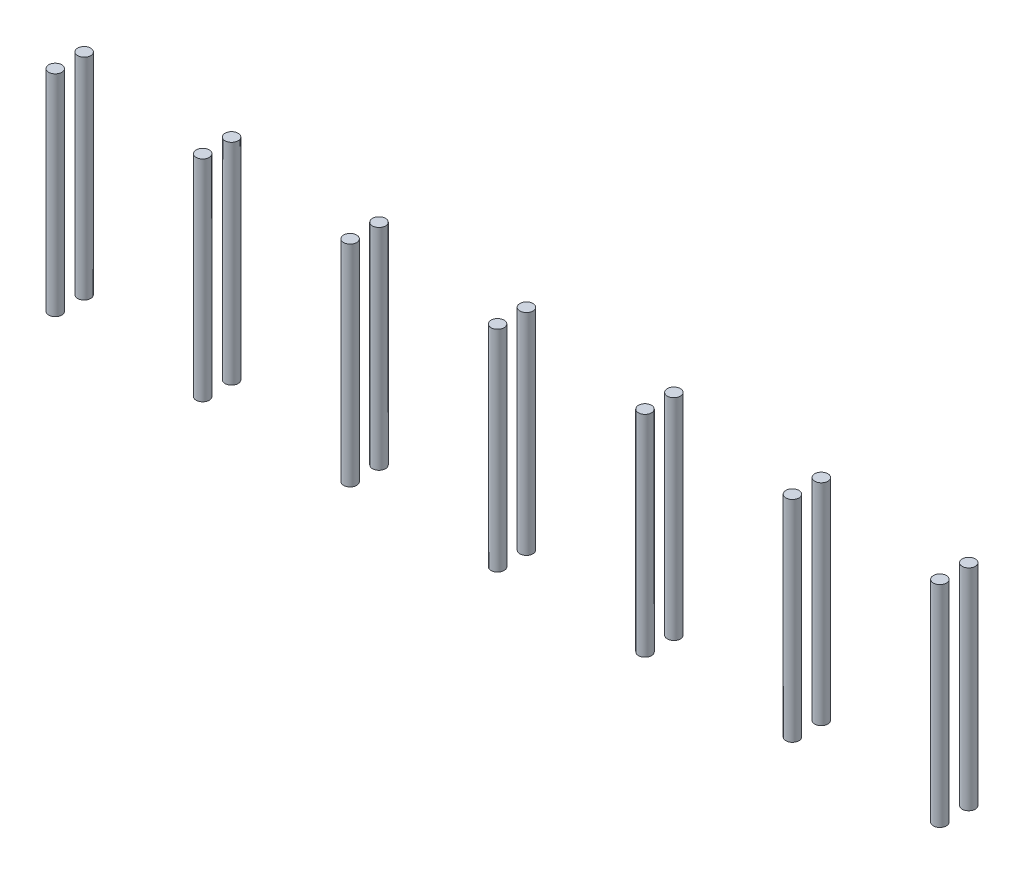
ISO-10303-21;
HEADER;
FILE_DESCRIPTION(('STEP AP214'),'2;1');
FILE_NAME('part.step','',(''),(''),'','','');
FILE_SCHEMA(('AUTOMOTIVE_DESIGN { 1 0 10303 214 1 1 1 1 }'));
ENDSEC;
DATA;
#1=APPLICATION_CONTEXT('core data for automotive mechanical design processes');
#2=APPLICATION_PROTOCOL_DEFINITION('international standard','automotive_design',2000,#1);
#3=PRODUCT_CONTEXT('',#1,'mechanical');
#4=PRODUCT('Part','Part','',(#3));
#5=PRODUCT_RELATED_PRODUCT_CATEGORY('part','',(#4));
#6=PRODUCT_DEFINITION_FORMATION('','',#4);
#7=PRODUCT_DEFINITION_CONTEXT('part definition',#1,'design');
#8=PRODUCT_DEFINITION('design','',#6,#7);
#9=PRODUCT_DEFINITION_SHAPE('','',#8);
#10=(LENGTH_UNIT() NAMED_UNIT(*) SI_UNIT(.MILLI.,.METRE.));
#11=(NAMED_UNIT(*) PLANE_ANGLE_UNIT() SI_UNIT($,.RADIAN.));
#12=(NAMED_UNIT(*) SI_UNIT($,.STERADIAN.) SOLID_ANGLE_UNIT());
#13=UNCERTAINTY_MEASURE_WITH_UNIT(LENGTH_MEASURE(1.E-05),#10,'distance_accuracy_value','');
#14=(GEOMETRIC_REPRESENTATION_CONTEXT(3) GLOBAL_UNCERTAINTY_ASSIGNED_CONTEXT((#13)) GLOBAL_UNIT_ASSIGNED_CONTEXT((#10,
#11,#12)) REPRESENTATION_CONTEXT('',''));
#15=CARTESIAN_POINT('',(0.,0.,0.));
#16=DIRECTION('',(0.,0.,1.));
#17=DIRECTION('',(1.,0.,0.));
#18=AXIS2_PLACEMENT_3D('',#15,#16,#17);
#19=CARTESIAN_POINT('',(362.5,109.980256121071,-27.9999999999911));
#20=DIRECTION('',(0.,-1.,0.));
#21=DIRECTION('',(1.,0.,0.));
#22=AXIS2_PLACEMENT_3D('',#19,#20,#21);
#23=CYLINDRICAL_SURFACE('',#22,3.17499999999997);
#24=CARTESIAN_POINT('',(362.5,-0.999999999998734,-27.9999999999911));
#25=DIRECTION('',(0.,1.,0.));
#26=DIRECTION('',(-1.,0.,0.));
#27=AXIS2_PLACEMENT_3D('',#24,#25,#26);
#28=CIRCLE('',#27,3.17499999999997);
#29=CARTESIAN_POINT('',(359.325,-0.999999999998745,-27.9999999999911));
#30=VERTEX_POINT('',#29);
#31=EDGE_CURVE('E52',#30,#30,#28,.T.);
#32=ORIENTED_EDGE('',*,*,#31,.T.);
#33=EDGE_LOOP('',(#32));
#34=FACE_BOUND('',#33,.T.);
#35=CARTESIAN_POINT('',(362.5,101.000000000001,-27.9999999999911));
#36=DIRECTION('',(0.,1.,0.));
#37=DIRECTION('',(-1.,0.,0.));
#38=AXIS2_PLACEMENT_3D('',#35,#36,#37);
#39=CIRCLE('',#38,3.17499999999997);
#40=CARTESIAN_POINT('',(359.325,101.000000000001,-27.9999999999911));
#41=VERTEX_POINT('',#40);
#42=EDGE_CURVE('E11',#41,#41,#39,.T.);
#43=ORIENTED_EDGE('',*,*,#42,.F.);
#44=EDGE_LOOP('',(#43));
#45=FACE_BOUND('',#44,.T.);
#46=ADVANCED_FACE('F44',(#34,#45),#23,.T.);
#47=CARTESIAN_POINT('',(362.5,-0.999999999998734,-27.9999999999911));
#48=DIRECTION('',(0.,1.,0.));
#49=DIRECTION('',(-1.,0.,0.));
#50=AXIS2_PLACEMENT_3D('',#47,#48,#49);
#51=PLANE('',#50);
#52=ORIENTED_EDGE('',*,*,#31,.F.);
#53=EDGE_LOOP('',(#52));
#54=FACE_BOUND('',#53,.T.);
#55=ADVANCED_FACE('F61',(#54),#51,.F.);
#56=CARTESIAN_POINT('',(-66.5000000000003,101.,-41.9999999999911));
#57=DIRECTION('',(0.,1.,0.));
#58=DIRECTION('',(-1.,0.,0.));
#59=AXIS2_PLACEMENT_3D('',#56,#57,#58);
#60=PLANE('',#59);
#61=ORIENTED_EDGE('',*,*,#42,.T.);
#62=EDGE_LOOP('',(#61));
#63=FACE_BOUND('',#62,.T.);
#64=ADVANCED_FACE('F46',(#63),#60,.T.);
#65=CLOSED_SHELL('',(#46,#55,#64));
#66=MANIFOLD_SOLID_BREP('B2',#65);
#67=CARTESIAN_POINT('',(362.5,109.980256121071,-41.9999999999911));
#68=DIRECTION('',(0.,-1.,0.));
#69=DIRECTION('',(1.,0.,0.));
#70=AXIS2_PLACEMENT_3D('',#67,#68,#69);
#71=CYLINDRICAL_SURFACE('',#70,3.17500000000002);
#72=CARTESIAN_POINT('',(362.5,-0.999999999998734,-41.9999999999911));
#73=DIRECTION('',(0.,1.,0.));
#74=DIRECTION('',(-1.,0.,0.));
#75=AXIS2_PLACEMENT_3D('',#72,#73,#74);
#76=CIRCLE('',#75,3.17500000000002);
#77=CARTESIAN_POINT('',(359.325,-0.999999999998745,-41.9999999999911));
#78=VERTEX_POINT('',#77);
#79=EDGE_CURVE('E106',#78,#78,#76,.T.);
#80=ORIENTED_EDGE('',*,*,#79,.T.);
#81=EDGE_LOOP('',(#80));
#82=FACE_BOUND('',#81,.T.);
#83=CARTESIAN_POINT('',(362.5,101.000000000001,-41.9999999999911));
#84=DIRECTION('',(0.,1.,0.));
#85=DIRECTION('',(-1.,0.,0.));
#86=AXIS2_PLACEMENT_3D('',#83,#84,#85);
#87=CIRCLE('',#86,3.17500000000002);
#88=CARTESIAN_POINT('',(359.325,101.000000000001,-41.9999999999911));
#89=VERTEX_POINT('',#88);
#90=EDGE_CURVE('E43',#89,#89,#87,.T.);
#91=ORIENTED_EDGE('',*,*,#90,.F.);
#92=EDGE_LOOP('',(#91));
#93=FACE_BOUND('',#92,.T.);
#94=ADVANCED_FACE('F98',(#82,#93),#71,.T.);
#95=CARTESIAN_POINT('',(362.5,-0.999999999998734,-41.9999999999911));
#96=DIRECTION('',(0.,1.,0.));
#97=DIRECTION('',(-1.,0.,0.));
#98=AXIS2_PLACEMENT_3D('',#95,#96,#97);
#99=PLANE('',#98);
#100=ORIENTED_EDGE('',*,*,#79,.F.);
#101=EDGE_LOOP('',(#100));
#102=FACE_BOUND('',#101,.T.);
#103=ADVANCED_FACE('F115',(#102),#99,.F.);
#104=CARTESIAN_POINT('',(-66.5000000000003,101.,-41.9999999999911));
#105=DIRECTION('',(0.,1.,0.));
#106=DIRECTION('',(-1.,0.,0.));
#107=AXIS2_PLACEMENT_3D('',#104,#105,#106);
#108=PLANE('',#107);
#109=ORIENTED_EDGE('',*,*,#90,.T.);
#110=EDGE_LOOP('',(#109));
#111=FACE_BOUND('',#110,.T.);
#112=ADVANCED_FACE('F100',(#111),#108,.T.);
#113=CLOSED_SHELL('',(#94,#103,#112));
#114=MANIFOLD_SOLID_BREP('B6',#113);
#115=CARTESIAN_POINT('',(291.,109.98025612107,-27.9999999999911));
#116=DIRECTION('',(0.,-1.,0.));
#117=DIRECTION('',(1.,0.,0.));
#118=AXIS2_PLACEMENT_3D('',#115,#116,#117);
#119=CYLINDRICAL_SURFACE('',#118,3.17499999999997);
#120=CARTESIAN_POINT('',(291.,-0.999999999998984,-27.9999999999911));
#121=DIRECTION('',(0.,1.,0.));
#122=DIRECTION('',(-1.,0.,0.));
#123=AXIS2_PLACEMENT_3D('',#120,#121,#122);
#124=CIRCLE('',#123,3.17499999999997);
#125=CARTESIAN_POINT('',(287.825,-0.999999999998995,-27.9999999999911));
#126=VERTEX_POINT('',#125);
#127=EDGE_CURVE('E160',#126,#126,#124,.T.);
#128=ORIENTED_EDGE('',*,*,#127,.T.);
#129=EDGE_LOOP('',(#128));
#130=FACE_BOUND('',#129,.T.);
#131=CARTESIAN_POINT('',(291.,101.000000000001,-27.9999999999911));
#132=DIRECTION('',(0.,1.,0.));
#133=DIRECTION('',(-1.,0.,0.));
#134=AXIS2_PLACEMENT_3D('',#131,#132,#133);
#135=CIRCLE('',#134,3.17499999999997);
#136=CARTESIAN_POINT('',(287.825,101.000000000001,-27.9999999999911));
#137=VERTEX_POINT('',#136);
#138=EDGE_CURVE('E97',#137,#137,#135,.T.);
#139=ORIENTED_EDGE('',*,*,#138,.F.);
#140=EDGE_LOOP('',(#139));
#141=FACE_BOUND('',#140,.T.);
#142=ADVANCED_FACE('F152',(#130,#141),#119,.T.);
#143=CARTESIAN_POINT('',(291.,-0.999999999998984,-27.9999999999911));
#144=DIRECTION('',(0.,1.,0.));
#145=DIRECTION('',(-1.,0.,0.));
#146=AXIS2_PLACEMENT_3D('',#143,#144,#145);
#147=PLANE('',#146);
#148=ORIENTED_EDGE('',*,*,#127,.F.);
#149=EDGE_LOOP('',(#148));
#150=FACE_BOUND('',#149,.T.);
#151=ADVANCED_FACE('F169',(#150),#147,.F.);
#152=CARTESIAN_POINT('',(-66.5000000000003,101.,-41.9999999999911));
#153=DIRECTION('',(0.,1.,0.));
#154=DIRECTION('',(-1.,0.,0.));
#155=AXIS2_PLACEMENT_3D('',#152,#153,#154);
#156=PLANE('',#155);
#157=ORIENTED_EDGE('',*,*,#138,.T.);
#158=EDGE_LOOP('',(#157));
#159=FACE_BOUND('',#158,.T.);
#160=ADVANCED_FACE('F154',(#159),#156,.T.);
#161=CLOSED_SHELL('',(#142,#151,#160));
#162=MANIFOLD_SOLID_BREP('B38',#161);
#163=CARTESIAN_POINT('',(291.,109.98025612107,-41.9999999999911));
#164=DIRECTION('',(0.,-1.,0.));
#165=DIRECTION('',(1.,0.,0.));
#166=AXIS2_PLACEMENT_3D('',#163,#164,#165);
#167=CYLINDRICAL_SURFACE('',#166,3.17500000000002);
#168=CARTESIAN_POINT('',(291.,-0.999999999998984,-41.9999999999911));
#169=DIRECTION('',(0.,1.,0.));
#170=DIRECTION('',(-1.,0.,0.));
#171=AXIS2_PLACEMENT_3D('',#168,#169,#170);
#172=CIRCLE('',#171,3.17500000000002);
#173=CARTESIAN_POINT('',(287.825,-0.999999999998995,-41.9999999999911));
#174=VERTEX_POINT('',#173);
#175=EDGE_CURVE('E214',#174,#174,#172,.T.);
#176=ORIENTED_EDGE('',*,*,#175,.T.);
#177=EDGE_LOOP('',(#176));
#178=FACE_BOUND('',#177,.T.);
#179=CARTESIAN_POINT('',(291.,101.000000000001,-41.9999999999911));
#180=DIRECTION('',(0.,1.,0.));
#181=DIRECTION('',(-1.,0.,0.));
#182=AXIS2_PLACEMENT_3D('',#179,#180,#181);
#183=CIRCLE('',#182,3.17500000000002);
#184=CARTESIAN_POINT('',(287.825,101.000000000001,-41.9999999999911));
#185=VERTEX_POINT('',#184);
#186=EDGE_CURVE('E151',#185,#185,#183,.T.);
#187=ORIENTED_EDGE('',*,*,#186,.F.);
#188=EDGE_LOOP('',(#187));
#189=FACE_BOUND('',#188,.T.);
#190=ADVANCED_FACE('F206',(#178,#189),#167,.T.);
#191=CARTESIAN_POINT('',(291.,-0.999999999998984,-41.9999999999911));
#192=DIRECTION('',(0.,1.,0.));
#193=DIRECTION('',(-1.,0.,0.));
#194=AXIS2_PLACEMENT_3D('',#191,#192,#193);
#195=PLANE('',#194);
#196=ORIENTED_EDGE('',*,*,#175,.F.);
#197=EDGE_LOOP('',(#196));
#198=FACE_BOUND('',#197,.T.);
#199=ADVANCED_FACE('F223',(#198),#195,.F.);
#200=CARTESIAN_POINT('',(-66.5000000000003,101.,-41.9999999999911));
#201=DIRECTION('',(0.,1.,0.));
#202=DIRECTION('',(-1.,0.,0.));
#203=AXIS2_PLACEMENT_3D('',#200,#201,#202);
#204=PLANE('',#203);
#205=ORIENTED_EDGE('',*,*,#186,.T.);
#206=EDGE_LOOP('',(#205));
#207=FACE_BOUND('',#206,.T.);
#208=ADVANCED_FACE('F208',(#207),#204,.T.);
#209=CLOSED_SHELL('',(#190,#199,#208));
#210=MANIFOLD_SOLID_BREP('B92',#209);
#211=CARTESIAN_POINT('',(219.5,109.98025612107,-27.9999999999911));
#212=DIRECTION('',(0.,-1.,0.));
#213=DIRECTION('',(1.,0.,0.));
#214=AXIS2_PLACEMENT_3D('',#211,#212,#213);
#215=CYLINDRICAL_SURFACE('',#214,3.17499999999997);
#216=CARTESIAN_POINT('',(219.5,-0.999999999999234,-27.9999999999911));
#217=DIRECTION('',(0.,1.,0.));
#218=DIRECTION('',(-1.,0.,0.));
#219=AXIS2_PLACEMENT_3D('',#216,#217,#218);
#220=CIRCLE('',#219,3.17499999999997);
#221=CARTESIAN_POINT('',(216.325,-0.999999999999245,-27.9999999999911));
#222=VERTEX_POINT('',#221);
#223=EDGE_CURVE('E268',#222,#222,#220,.T.);
#224=ORIENTED_EDGE('',*,*,#223,.T.);
#225=EDGE_LOOP('',(#224));
#226=FACE_BOUND('',#225,.T.);
#227=CARTESIAN_POINT('',(219.5,101.000000000001,-27.9999999999911));
#228=DIRECTION('',(0.,1.,0.));
#229=DIRECTION('',(-1.,0.,0.));
#230=AXIS2_PLACEMENT_3D('',#227,#228,#229);
#231=CIRCLE('',#230,3.17499999999997);
#232=CARTESIAN_POINT('',(216.325,101.000000000001,-27.9999999999911));
#233=VERTEX_POINT('',#232);
#234=EDGE_CURVE('E205',#233,#233,#231,.T.);
#235=ORIENTED_EDGE('',*,*,#234,.F.);
#236=EDGE_LOOP('',(#235));
#237=FACE_BOUND('',#236,.T.);
#238=ADVANCED_FACE('F260',(#226,#237),#215,.T.);
#239=CARTESIAN_POINT('',(219.5,-0.999999999999234,-27.9999999999911));
#240=DIRECTION('',(0.,1.,0.));
#241=DIRECTION('',(-1.,0.,0.));
#242=AXIS2_PLACEMENT_3D('',#239,#240,#241);
#243=PLANE('',#242);
#244=ORIENTED_EDGE('',*,*,#223,.F.);
#245=EDGE_LOOP('',(#244));
#246=FACE_BOUND('',#245,.T.);
#247=ADVANCED_FACE('F277',(#246),#243,.F.);
#248=CARTESIAN_POINT('',(-66.5000000000003,101.,-41.9999999999911));
#249=DIRECTION('',(0.,1.,0.));
#250=DIRECTION('',(-1.,0.,0.));
#251=AXIS2_PLACEMENT_3D('',#248,#249,#250);
#252=PLANE('',#251);
#253=ORIENTED_EDGE('',*,*,#234,.T.);
#254=EDGE_LOOP('',(#253));
#255=FACE_BOUND('',#254,.T.);
#256=ADVANCED_FACE('F262',(#255),#252,.T.);
#257=CLOSED_SHELL('',(#238,#247,#256));
#258=MANIFOLD_SOLID_BREP('B146',#257);
#259=CARTESIAN_POINT('',(219.5,109.98025612107,-41.9999999999911));
#260=DIRECTION('',(0.,-1.,0.));
#261=DIRECTION('',(1.,0.,0.));
#262=AXIS2_PLACEMENT_3D('',#259,#260,#261);
#263=CYLINDRICAL_SURFACE('',#262,3.17500000000002);
#264=CARTESIAN_POINT('',(219.5,-0.999999999999234,-41.9999999999911));
#265=DIRECTION('',(0.,1.,0.));
#266=DIRECTION('',(-1.,0.,0.));
#267=AXIS2_PLACEMENT_3D('',#264,#265,#266);
#268=CIRCLE('',#267,3.17500000000002);
#269=CARTESIAN_POINT('',(216.325,-0.999999999999245,-41.9999999999911));
#270=VERTEX_POINT('',#269);
#271=EDGE_CURVE('E322',#270,#270,#268,.T.);
#272=ORIENTED_EDGE('',*,*,#271,.T.);
#273=EDGE_LOOP('',(#272));
#274=FACE_BOUND('',#273,.T.);
#275=CARTESIAN_POINT('',(219.5,101.000000000001,-41.9999999999911));
#276=DIRECTION('',(0.,1.,0.));
#277=DIRECTION('',(-1.,0.,0.));
#278=AXIS2_PLACEMENT_3D('',#275,#276,#277);
#279=CIRCLE('',#278,3.17500000000002);
#280=CARTESIAN_POINT('',(216.325,101.000000000001,-41.9999999999911));
#281=VERTEX_POINT('',#280);
#282=EDGE_CURVE('E259',#281,#281,#279,.T.);
#283=ORIENTED_EDGE('',*,*,#282,.F.);
#284=EDGE_LOOP('',(#283));
#285=FACE_BOUND('',#284,.T.);
#286=ADVANCED_FACE('F314',(#274,#285),#263,.T.);
#287=CARTESIAN_POINT('',(219.5,-0.999999999999234,-41.9999999999911));
#288=DIRECTION('',(0.,1.,0.));
#289=DIRECTION('',(-1.,0.,0.));
#290=AXIS2_PLACEMENT_3D('',#287,#288,#289);
#291=PLANE('',#290);
#292=ORIENTED_EDGE('',*,*,#271,.F.);
#293=EDGE_LOOP('',(#292));
#294=FACE_BOUND('',#293,.T.);
#295=ADVANCED_FACE('F331',(#294),#291,.F.);
#296=CARTESIAN_POINT('',(-66.5000000000003,101.,-41.9999999999911));
#297=DIRECTION('',(0.,1.,0.));
#298=DIRECTION('',(-1.,0.,0.));
#299=AXIS2_PLACEMENT_3D('',#296,#297,#298);
#300=PLANE('',#299);
#301=ORIENTED_EDGE('',*,*,#282,.T.);
#302=EDGE_LOOP('',(#301));
#303=FACE_BOUND('',#302,.T.);
#304=ADVANCED_FACE('F316',(#303),#300,.T.);
#305=CLOSED_SHELL('',(#286,#295,#304));
#306=MANIFOLD_SOLID_BREP('B200',#305);
#307=CARTESIAN_POINT('',(148.,109.98025612107,-27.9999999999911));
#308=DIRECTION('',(0.,-1.,0.));
#309=DIRECTION('',(1.,0.,0.));
#310=AXIS2_PLACEMENT_3D('',#307,#308,#309);
#311=CYLINDRICAL_SURFACE('',#310,3.17499999999997);
#312=CARTESIAN_POINT('',(148.,-0.999999999999483,-27.9999999999911));
#313=DIRECTION('',(0.,1.,0.));
#314=DIRECTION('',(-1.,0.,0.));
#315=AXIS2_PLACEMENT_3D('',#312,#313,#314);
#316=CIRCLE('',#315,3.17499999999997);
#317=CARTESIAN_POINT('',(144.825,-0.999999999999494,-27.9999999999911));
#318=VERTEX_POINT('',#317);
#319=EDGE_CURVE('E376',#318,#318,#316,.T.);
#320=ORIENTED_EDGE('',*,*,#319,.T.);
#321=EDGE_LOOP('',(#320));
#322=FACE_BOUND('',#321,.T.);
#323=CARTESIAN_POINT('',(148.,101.000000000001,-27.9999999999911));
#324=DIRECTION('',(0.,1.,0.));
#325=DIRECTION('',(-1.,0.,0.));
#326=AXIS2_PLACEMENT_3D('',#323,#324,#325);
#327=CIRCLE('',#326,3.17499999999997);
#328=CARTESIAN_POINT('',(144.825,101.000000000001,-27.9999999999911));
#329=VERTEX_POINT('',#328);
#330=EDGE_CURVE('E313',#329,#329,#327,.T.);
#331=ORIENTED_EDGE('',*,*,#330,.F.);
#332=EDGE_LOOP('',(#331));
#333=FACE_BOUND('',#332,.T.);
#334=ADVANCED_FACE('F368',(#322,#333),#311,.T.);
#335=CARTESIAN_POINT('',(148.,-0.999999999999483,-27.9999999999911));
#336=DIRECTION('',(0.,1.,0.));
#337=DIRECTION('',(-1.,0.,0.));
#338=AXIS2_PLACEMENT_3D('',#335,#336,#337);
#339=PLANE('',#338);
#340=ORIENTED_EDGE('',*,*,#319,.F.);
#341=EDGE_LOOP('',(#340));
#342=FACE_BOUND('',#341,.T.);
#343=ADVANCED_FACE('F385',(#342),#339,.F.);
#344=CARTESIAN_POINT('',(-66.5000000000003,101.,-41.9999999999911));
#345=DIRECTION('',(0.,1.,0.));
#346=DIRECTION('',(-1.,0.,0.));
#347=AXIS2_PLACEMENT_3D('',#344,#345,#346);
#348=PLANE('',#347);
#349=ORIENTED_EDGE('',*,*,#330,.T.);
#350=EDGE_LOOP('',(#349));
#351=FACE_BOUND('',#350,.T.);
#352=ADVANCED_FACE('F370',(#351),#348,.T.);
#353=CLOSED_SHELL('',(#334,#343,#352));
#354=MANIFOLD_SOLID_BREP('B254',#353);
#355=CARTESIAN_POINT('',(148.,109.98025612107,-41.9999999999911));
#356=DIRECTION('',(0.,-1.,0.));
#357=DIRECTION('',(1.,0.,0.));
#358=AXIS2_PLACEMENT_3D('',#355,#356,#357);
#359=CYLINDRICAL_SURFACE('',#358,3.17500000000002);
#360=CARTESIAN_POINT('',(148.,-0.999999999999483,-41.9999999999911));
#361=DIRECTION('',(0.,1.,0.));
#362=DIRECTION('',(-1.,0.,0.));
#363=AXIS2_PLACEMENT_3D('',#360,#361,#362);
#364=CIRCLE('',#363,3.17500000000002);
#365=CARTESIAN_POINT('',(144.825,-0.999999999999494,-41.9999999999911));
#366=VERTEX_POINT('',#365);
#367=EDGE_CURVE('E430',#366,#366,#364,.T.);
#368=ORIENTED_EDGE('',*,*,#367,.T.);
#369=EDGE_LOOP('',(#368));
#370=FACE_BOUND('',#369,.T.);
#371=CARTESIAN_POINT('',(148.,101.000000000001,-41.9999999999911));
#372=DIRECTION('',(0.,1.,0.));
#373=DIRECTION('',(-1.,0.,0.));
#374=AXIS2_PLACEMENT_3D('',#371,#372,#373);
#375=CIRCLE('',#374,3.17500000000002);
#376=CARTESIAN_POINT('',(144.825,101.000000000001,-41.9999999999911));
#377=VERTEX_POINT('',#376);
#378=EDGE_CURVE('E367',#377,#377,#375,.T.);
#379=ORIENTED_EDGE('',*,*,#378,.F.);
#380=EDGE_LOOP('',(#379));
#381=FACE_BOUND('',#380,.T.);
#382=ADVANCED_FACE('F422',(#370,#381),#359,.T.);
#383=CARTESIAN_POINT('',(148.,-0.999999999999483,-41.9999999999911));
#384=DIRECTION('',(0.,1.,0.));
#385=DIRECTION('',(-1.,0.,0.));
#386=AXIS2_PLACEMENT_3D('',#383,#384,#385);
#387=PLANE('',#386);
#388=ORIENTED_EDGE('',*,*,#367,.F.);
#389=EDGE_LOOP('',(#388));
#390=FACE_BOUND('',#389,.T.);
#391=ADVANCED_FACE('F439',(#390),#387,.F.);
#392=CARTESIAN_POINT('',(-66.5000000000003,101.,-41.9999999999911));
#393=DIRECTION('',(0.,1.,0.));
#394=DIRECTION('',(-1.,0.,0.));
#395=AXIS2_PLACEMENT_3D('',#392,#393,#394);
#396=PLANE('',#395);
#397=ORIENTED_EDGE('',*,*,#378,.T.);
#398=EDGE_LOOP('',(#397));
#399=FACE_BOUND('',#398,.T.);
#400=ADVANCED_FACE('F424',(#399),#396,.T.);
#401=CLOSED_SHELL('',(#382,#391,#400));
#402=MANIFOLD_SOLID_BREP('B308',#401);
#403=CARTESIAN_POINT('',(76.4999999999996,109.98025612107,-27.9999999999911));
#404=DIRECTION('',(0.,-1.,0.));
#405=DIRECTION('',(1.,0.,0.));
#406=AXIS2_PLACEMENT_3D('',#403,#404,#405);
#407=CYLINDRICAL_SURFACE('',#406,3.175);
#408=CARTESIAN_POINT('',(76.5,-0.999999999999733,-27.9999999999911));
#409=DIRECTION('',(0.,1.,0.));
#410=DIRECTION('',(-1.,0.,0.));
#411=AXIS2_PLACEMENT_3D('',#408,#409,#410);
#412=CIRCLE('',#411,3.175);
#413=CARTESIAN_POINT('',(73.325,-0.999999999999744,-27.9999999999911));
#414=VERTEX_POINT('',#413);
#415=EDGE_CURVE('E484',#414,#414,#412,.T.);
#416=ORIENTED_EDGE('',*,*,#415,.T.);
#417=EDGE_LOOP('',(#416));
#418=FACE_BOUND('',#417,.T.);
#419=CARTESIAN_POINT('',(76.4999999999997,101.,-27.9999999999911));
#420=DIRECTION('',(0.,1.,0.));
#421=DIRECTION('',(-1.,0.,0.));
#422=AXIS2_PLACEMENT_3D('',#419,#420,#421);
#423=CIRCLE('',#422,3.175);
#424=CARTESIAN_POINT('',(73.3249999999997,101.,-27.9999999999911));
#425=VERTEX_POINT('',#424);
#426=EDGE_CURVE('E421',#425,#425,#423,.T.);
#427=ORIENTED_EDGE('',*,*,#426,.F.);
#428=EDGE_LOOP('',(#427));
#429=FACE_BOUND('',#428,.T.);
#430=ADVANCED_FACE('F476',(#418,#429),#407,.T.);
#431=CARTESIAN_POINT('',(76.5,-0.999999999999733,-27.9999999999911));
#432=DIRECTION('',(0.,1.,0.));
#433=DIRECTION('',(-1.,0.,0.));
#434=AXIS2_PLACEMENT_3D('',#431,#432,#433);
#435=PLANE('',#434);
#436=ORIENTED_EDGE('',*,*,#415,.F.);
#437=EDGE_LOOP('',(#436));
#438=FACE_BOUND('',#437,.T.);
#439=ADVANCED_FACE('F493',(#438),#435,.F.);
#440=CARTESIAN_POINT('',(-66.5000000000003,101.,-41.9999999999911));
#441=DIRECTION('',(0.,1.,0.));
#442=DIRECTION('',(-1.,0.,0.));
#443=AXIS2_PLACEMENT_3D('',#440,#441,#442);
#444=PLANE('',#443);
#445=ORIENTED_EDGE('',*,*,#426,.T.);
#446=EDGE_LOOP('',(#445));
#447=FACE_BOUND('',#446,.T.);
#448=ADVANCED_FACE('F478',(#447),#444,.T.);
#449=CLOSED_SHELL('',(#430,#439,#448));
#450=MANIFOLD_SOLID_BREP('B362',#449);
#451=CARTESIAN_POINT('',(76.4999999999997,109.98025612107,-41.9999999999911));
#452=DIRECTION('',(0.,-1.,0.));
#453=DIRECTION('',(1.,0.,0.));
#454=AXIS2_PLACEMENT_3D('',#451,#452,#453);
#455=CYLINDRICAL_SURFACE('',#454,3.175);
#456=CARTESIAN_POINT('',(76.5000000000001,-0.999999999999733,-41.9999999999911));
#457=DIRECTION('',(0.,1.,0.));
#458=DIRECTION('',(-1.,0.,0.));
#459=AXIS2_PLACEMENT_3D('',#456,#457,#458);
#460=CIRCLE('',#459,3.175);
#461=CARTESIAN_POINT('',(73.3250000000001,-0.999999999999744,-41.9999999999911));
#462=VERTEX_POINT('',#461);
#463=EDGE_CURVE('E538',#462,#462,#460,.T.);
#464=ORIENTED_EDGE('',*,*,#463,.T.);
#465=EDGE_LOOP('',(#464));
#466=FACE_BOUND('',#465,.T.);
#467=CARTESIAN_POINT('',(76.4999999999997,101.,-41.9999999999911));
#468=DIRECTION('',(0.,1.,0.));
#469=DIRECTION('',(-1.,0.,0.));
#470=AXIS2_PLACEMENT_3D('',#467,#468,#469);
#471=CIRCLE('',#470,3.175);
#472=CARTESIAN_POINT('',(73.3249999999997,101.,-41.9999999999911));
#473=VERTEX_POINT('',#472);
#474=EDGE_CURVE('E475',#473,#473,#471,.T.);
#475=ORIENTED_EDGE('',*,*,#474,.F.);
#476=EDGE_LOOP('',(#475));
#477=FACE_BOUND('',#476,.T.);
#478=ADVANCED_FACE('F530',(#466,#477),#455,.T.);
#479=CARTESIAN_POINT('',(76.5000000000001,-0.999999999999733,-41.9999999999911));
#480=DIRECTION('',(0.,1.,0.));
#481=DIRECTION('',(-1.,0.,0.));
#482=AXIS2_PLACEMENT_3D('',#479,#480,#481);
#483=PLANE('',#482);
#484=ORIENTED_EDGE('',*,*,#463,.F.);
#485=EDGE_LOOP('',(#484));
#486=FACE_BOUND('',#485,.T.);
#487=ADVANCED_FACE('F547',(#486),#483,.F.);
#488=CARTESIAN_POINT('',(-66.5000000000003,101.,-41.9999999999911));
#489=DIRECTION('',(0.,1.,0.));
#490=DIRECTION('',(-1.,0.,0.));
#491=AXIS2_PLACEMENT_3D('',#488,#489,#490);
#492=PLANE('',#491);
#493=ORIENTED_EDGE('',*,*,#474,.T.);
#494=EDGE_LOOP('',(#493));
#495=FACE_BOUND('',#494,.T.);
#496=ADVANCED_FACE('F532',(#495),#492,.T.);
#497=CLOSED_SHELL('',(#478,#487,#496));
#498=MANIFOLD_SOLID_BREP('B416',#497);
#499=CARTESIAN_POINT('',(4.99999999999965,109.980256121069,-27.9999999999911));
#500=DIRECTION('',(0.,-1.,0.));
#501=DIRECTION('',(1.,0.,0.));
#502=AXIS2_PLACEMENT_3D('',#499,#500,#501);
#503=CYLINDRICAL_SURFACE('',#502,3.175);
#504=CARTESIAN_POINT('',(5.00000000000004,-0.999999999999982,-27.9999999999911));
#505=DIRECTION('',(0.,1.,0.));
#506=DIRECTION('',(-1.,0.,0.));
#507=AXIS2_PLACEMENT_3D('',#504,#505,#506);
#508=CIRCLE('',#507,3.175);
#509=CARTESIAN_POINT('',(1.82500000000004,-0.999999999999993,-27.9999999999911));
#510=VERTEX_POINT('',#509);
#511=EDGE_CURVE('E592',#510,#510,#508,.T.);
#512=ORIENTED_EDGE('',*,*,#511,.T.);
#513=EDGE_LOOP('',(#512));
#514=FACE_BOUND('',#513,.T.);
#515=CARTESIAN_POINT('',(4.99999999999968,101.,-27.9999999999911));
#516=DIRECTION('',(0.,1.,0.));
#517=DIRECTION('',(-1.,0.,0.));
#518=AXIS2_PLACEMENT_3D('',#515,#516,#517);
#519=CIRCLE('',#518,3.175);
#520=CARTESIAN_POINT('',(1.82499999999968,101.,-27.9999999999911));
#521=VERTEX_POINT('',#520);
#522=EDGE_CURVE('E529',#521,#521,#519,.T.);
#523=ORIENTED_EDGE('',*,*,#522,.F.);
#524=EDGE_LOOP('',(#523));
#525=FACE_BOUND('',#524,.T.);
#526=ADVANCED_FACE('F584',(#514,#525),#503,.T.);
#527=CARTESIAN_POINT('',(5.00000000000004,-0.999999999999982,-27.9999999999911));
#528=DIRECTION('',(0.,1.,0.));
#529=DIRECTION('',(-1.,0.,0.));
#530=AXIS2_PLACEMENT_3D('',#527,#528,#529);
#531=PLANE('',#530);
#532=ORIENTED_EDGE('',*,*,#511,.F.);
#533=EDGE_LOOP('',(#532));
#534=FACE_BOUND('',#533,.T.);
#535=ADVANCED_FACE('F601',(#534),#531,.F.);
#536=CARTESIAN_POINT('',(-66.5000000000003,101.,-41.9999999999911));
#537=DIRECTION('',(0.,1.,0.));
#538=DIRECTION('',(-1.,0.,0.));
#539=AXIS2_PLACEMENT_3D('',#536,#537,#538);
#540=PLANE('',#539);
#541=ORIENTED_EDGE('',*,*,#522,.T.);
#542=EDGE_LOOP('',(#541));
#543=FACE_BOUND('',#542,.T.);
#544=ADVANCED_FACE('F586',(#543),#540,.T.);
#545=CLOSED_SHELL('',(#526,#535,#544));
#546=MANIFOLD_SOLID_BREP('B470',#545);
#547=CARTESIAN_POINT('',(4.99999999999968,109.980256121069,-41.9999999999911));
#548=DIRECTION('',(0.,-1.,0.));
#549=DIRECTION('',(1.,0.,0.));
#550=AXIS2_PLACEMENT_3D('',#547,#548,#549);
#551=CYLINDRICAL_SURFACE('',#550,3.175);
#552=CARTESIAN_POINT('',(5.00000000000006,-0.999999999999982,-41.9999999999911));
#553=DIRECTION('',(0.,1.,0.));
#554=DIRECTION('',(-1.,0.,0.));
#555=AXIS2_PLACEMENT_3D('',#552,#553,#554);
#556=CIRCLE('',#555,3.175);
#557=CARTESIAN_POINT('',(1.82500000000007,-0.999999999999993,-41.9999999999911));
#558=VERTEX_POINT('',#557);
#559=EDGE_CURVE('E646',#558,#558,#556,.T.);
#560=ORIENTED_EDGE('',*,*,#559,.T.);
#561=EDGE_LOOP('',(#560));
#562=FACE_BOUND('',#561,.T.);
#563=CARTESIAN_POINT('',(4.99999999999971,101.,-41.9999999999911));
#564=DIRECTION('',(0.,1.,0.));
#565=DIRECTION('',(-1.,0.,0.));
#566=AXIS2_PLACEMENT_3D('',#563,#564,#565);
#567=CIRCLE('',#566,3.175);
#568=CARTESIAN_POINT('',(1.82499999999971,101.,-41.9999999999911));
#569=VERTEX_POINT('',#568);
#570=EDGE_CURVE('E583',#569,#569,#567,.T.);
#571=ORIENTED_EDGE('',*,*,#570,.F.);
#572=EDGE_LOOP('',(#571));
#573=FACE_BOUND('',#572,.T.);
#574=ADVANCED_FACE('F638',(#562,#573),#551,.T.);
#575=CARTESIAN_POINT('',(5.00000000000006,-0.999999999999982,-41.9999999999911));
#576=DIRECTION('',(0.,1.,0.));
#577=DIRECTION('',(-1.,0.,0.));
#578=AXIS2_PLACEMENT_3D('',#575,#576,#577);
#579=PLANE('',#578);
#580=ORIENTED_EDGE('',*,*,#559,.F.);
#581=EDGE_LOOP('',(#580));
#582=FACE_BOUND('',#581,.T.);
#583=ADVANCED_FACE('F655',(#582),#579,.F.);
#584=CARTESIAN_POINT('',(-66.5000000000003,101.,-41.9999999999911));
#585=DIRECTION('',(0.,1.,0.));
#586=DIRECTION('',(-1.,0.,0.));
#587=AXIS2_PLACEMENT_3D('',#584,#585,#586);
#588=PLANE('',#587);
#589=ORIENTED_EDGE('',*,*,#570,.T.);
#590=EDGE_LOOP('',(#589));
#591=FACE_BOUND('',#590,.T.);
#592=ADVANCED_FACE('F640',(#591),#588,.T.);
#593=CLOSED_SHELL('',(#574,#583,#592));
#594=MANIFOLD_SOLID_BREP('B524',#593);
#595=CARTESIAN_POINT('',(-66.5000000000004,109.980256121069,-27.9999999999911));
#596=DIRECTION('',(0.,-1.,0.));
#597=DIRECTION('',(1.,0.,0.));
#598=AXIS2_PLACEMENT_3D('',#595,#596,#597);
#599=CYLINDRICAL_SURFACE('',#598,3.175);
#600=CARTESIAN_POINT('',(-66.5,-1.00000000000023,-27.9999999999911));
#601=DIRECTION('',(0.,1.,0.));
#602=DIRECTION('',(-1.,0.,0.));
#603=AXIS2_PLACEMENT_3D('',#600,#601,#602);
#604=CIRCLE('',#603,3.175);
#605=CARTESIAN_POINT('',(-69.675,-1.00000000000024,-27.9999999999911));
#606=VERTEX_POINT('',#605);
#607=EDGE_CURVE('E699',#606,#606,#604,.T.);
#608=ORIENTED_EDGE('',*,*,#607,.T.);
#609=EDGE_LOOP('',(#608));
#610=FACE_BOUND('',#609,.T.);
#611=CARTESIAN_POINT('',(-66.5000000000003,101.,-27.9999999999911));
#612=DIRECTION('',(0.,1.,0.));
#613=DIRECTION('',(-1.,0.,0.));
#614=AXIS2_PLACEMENT_3D('',#611,#612,#613);
#615=CIRCLE('',#614,3.175);
#616=CARTESIAN_POINT('',(-69.6750000000003,101.,-27.9999999999911));
#617=VERTEX_POINT('',#616);
#618=EDGE_CURVE('E637',#617,#617,#615,.T.);
#619=ORIENTED_EDGE('',*,*,#618,.F.);
#620=EDGE_LOOP('',(#619));
#621=FACE_BOUND('',#620,.T.);
#622=ADVANCED_FACE('F691',(#610,#621),#599,.T.);
#623=CARTESIAN_POINT('',(-66.5,-1.00000000000023,-27.9999999999911));
#624=DIRECTION('',(0.,1.,0.));
#625=DIRECTION('',(-1.,0.,0.));
#626=AXIS2_PLACEMENT_3D('',#623,#624,#625);
#627=PLANE('',#626);
#628=ORIENTED_EDGE('',*,*,#607,.F.);
#629=EDGE_LOOP('',(#628));
#630=FACE_BOUND('',#629,.T.);
#631=ADVANCED_FACE('F708',(#630),#627,.F.);
#632=CARTESIAN_POINT('',(-66.5000000000003,101.,-41.9999999999911));
#633=DIRECTION('',(0.,1.,0.));
#634=DIRECTION('',(-1.,0.,0.));
#635=AXIS2_PLACEMENT_3D('',#632,#633,#634);
#636=PLANE('',#635);
#637=ORIENTED_EDGE('',*,*,#618,.T.);
#638=EDGE_LOOP('',(#637));
#639=FACE_BOUND('',#638,.T.);
#640=ADVANCED_FACE('F693',(#639),#636,.T.);
#641=CLOSED_SHELL('',(#622,#631,#640));
#642=MANIFOLD_SOLID_BREP('B578',#641);
#643=CARTESIAN_POINT('',(-66.5000000000003,109.980256121069,-41.9999999999911));
#644=DIRECTION('',(0.,-1.,0.));
#645=DIRECTION('',(1.,0.,0.));
#646=AXIS2_PLACEMENT_3D('',#643,#644,#645);
#647=CYLINDRICAL_SURFACE('',#646,3.175);
#648=CARTESIAN_POINT('',(-66.4999999999999,-1.00000000000023,-41.9999999999911));
#649=DIRECTION('',(0.,1.,0.));
#650=DIRECTION('',(-1.,0.,0.));
#651=AXIS2_PLACEMENT_3D('',#648,#649,#650);
#652=CIRCLE('',#651,3.175);
#653=CARTESIAN_POINT('',(-69.6749999999999,-1.00000000000024,-41.9999999999911));
#654=VERTEX_POINT('',#653);
#655=EDGE_CURVE('E745',#654,#654,#652,.T.);
#656=ORIENTED_EDGE('',*,*,#655,.T.);
#657=EDGE_LOOP('',(#656));
#658=FACE_BOUND('',#657,.T.);
#659=CARTESIAN_POINT('',(-66.5000000000003,101.,-41.9999999999911));
#660=DIRECTION('',(0.,1.,0.));
#661=DIRECTION('',(-1.,0.,0.));
#662=AXIS2_PLACEMENT_3D('',#659,#660,#661);
#663=CIRCLE('',#662,3.175);
#664=CARTESIAN_POINT('',(-69.6750000000003,101.,-41.9999999999911));
#665=VERTEX_POINT('',#664);
#666=EDGE_CURVE('E690',#665,#665,#663,.T.);
#667=ORIENTED_EDGE('',*,*,#666,.F.);
#668=EDGE_LOOP('',(#667));
#669=FACE_BOUND('',#668,.T.);
#670=ADVANCED_FACE('F737',(#658,#669),#647,.T.);
#671=CARTESIAN_POINT('',(-66.4999999999999,-1.00000000000023,-41.9999999999911));
#672=DIRECTION('',(0.,1.,0.));
#673=DIRECTION('',(-1.,0.,0.));
#674=AXIS2_PLACEMENT_3D('',#671,#672,#673);
#675=PLANE('',#674);
#676=ORIENTED_EDGE('',*,*,#655,.F.);
#677=EDGE_LOOP('',(#676));
#678=FACE_BOUND('',#677,.T.);
#679=ADVANCED_FACE('F754',(#678),#675,.F.);
#680=CARTESIAN_POINT('',(-66.5000000000003,101.,-41.9999999999911));
#681=DIRECTION('',(0.,1.,0.));
#682=DIRECTION('',(-1.,0.,0.));
#683=AXIS2_PLACEMENT_3D('',#680,#681,#682);
#684=PLANE('',#683);
#685=ORIENTED_EDGE('',*,*,#666,.T.);
#686=EDGE_LOOP('',(#685));
#687=FACE_BOUND('',#686,.T.);
#688=ADVANCED_FACE('F739',(#687),#684,.T.);
#689=CLOSED_SHELL('',(#670,#679,#688));
#690=MANIFOLD_SOLID_BREP('B632',#689);
#691=ADVANCED_BREP_SHAPE_REPRESENTATION('',(#18,#66,#114,#162,#210,#258,#306,#354,#402,#450,
#498,#546,#594,#642,#690),#14);
#692=SHAPE_DEFINITION_REPRESENTATION(#9,#691);
ENDSEC;
END-ISO-10303-21;
